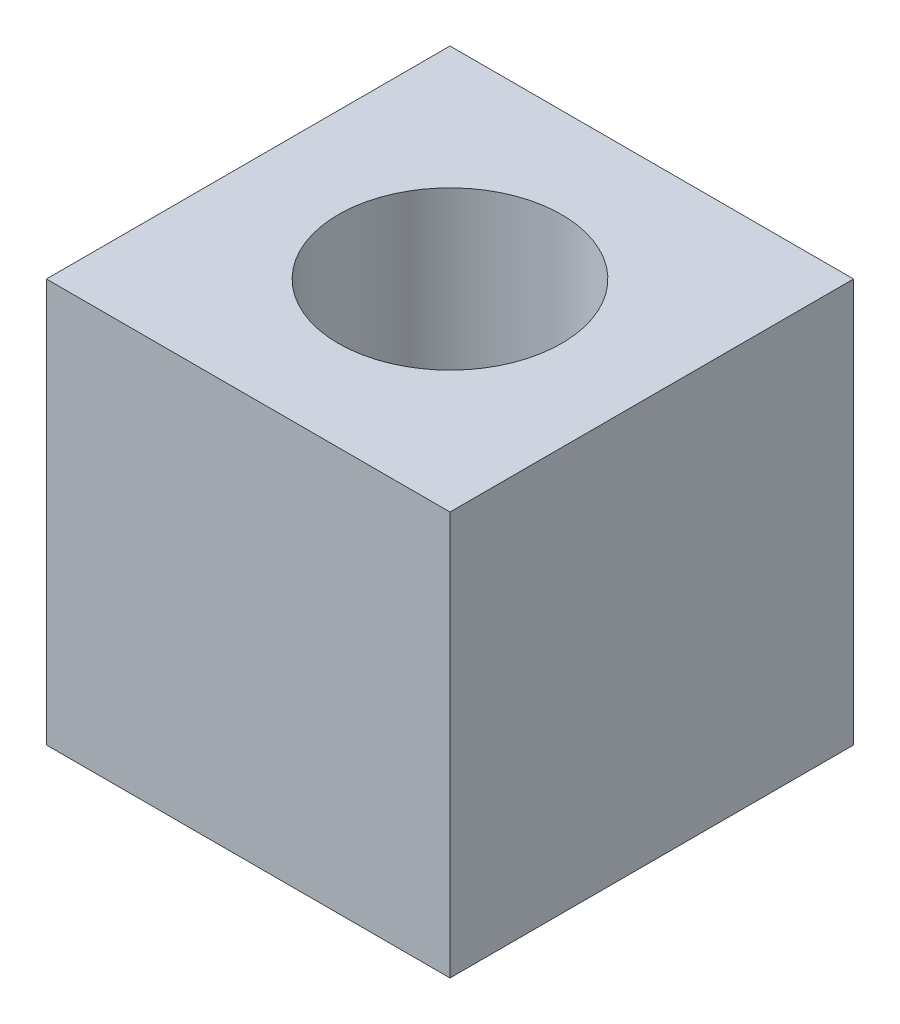
ISO-10303-21;
HEADER;
FILE_DESCRIPTION(('STEP AP214'),'2;1');
FILE_NAME('part.step','',(''),(''),'','','');
FILE_SCHEMA(('AUTOMOTIVE_DESIGN { 1 0 10303 214 1 1 1 1 }'));
ENDSEC;
DATA;
#1=APPLICATION_CONTEXT('core data for automotive mechanical design processes');
#2=APPLICATION_PROTOCOL_DEFINITION('international standard','automotive_design',2000,#1);
#3=PRODUCT_CONTEXT('',#1,'mechanical');
#4=PRODUCT('Part','Part','',(#3));
#5=PRODUCT_RELATED_PRODUCT_CATEGORY('part','',(#4));
#6=PRODUCT_DEFINITION_FORMATION('','',#4);
#7=PRODUCT_DEFINITION_CONTEXT('part definition',#1,'design');
#8=PRODUCT_DEFINITION('design','',#6,#7);
#9=PRODUCT_DEFINITION_SHAPE('','',#8);
#10=(LENGTH_UNIT() NAMED_UNIT(*) SI_UNIT(.MILLI.,.METRE.));
#11=(NAMED_UNIT(*) PLANE_ANGLE_UNIT() SI_UNIT($,.RADIAN.));
#12=(NAMED_UNIT(*) SI_UNIT($,.STERADIAN.) SOLID_ANGLE_UNIT());
#13=UNCERTAINTY_MEASURE_WITH_UNIT(LENGTH_MEASURE(1.E-05),#10,'distance_accuracy_value','');
#14=(GEOMETRIC_REPRESENTATION_CONTEXT(3) GLOBAL_UNCERTAINTY_ASSIGNED_CONTEXT((#13)) GLOBAL_UNIT_ASSIGNED_CONTEXT((#10,
#11,#12)) REPRESENTATION_CONTEXT('',''));
#15=CARTESIAN_POINT('',(0.,0.,0.));
#16=DIRECTION('',(0.,0.,1.));
#17=DIRECTION('',(1.,0.,0.));
#18=AXIS2_PLACEMENT_3D('',#15,#16,#17);
#19=CARTESIAN_POINT('',(0.,15.,0.));
#20=DIRECTION('',(0.,1.,0.));
#21=DIRECTION('',(0.,0.,1.));
#22=AXIS2_PLACEMENT_3D('',#19,#20,#21);
#23=PLANE('',#22);
#24=DIRECTION('',(0.,0.,1.));
#25=VECTOR('',#24,1.);
#26=CARTESIAN_POINT('',(-7.5,15.,-7.5));
#27=LINE('',#26,#25);
#28=CARTESIAN_POINT('',(-7.5,15.,-7.5));
#29=VERTEX_POINT('',#28);
#30=CARTESIAN_POINT('',(-7.5,15.,7.5));
#31=VERTEX_POINT('',#30);
#32=EDGE_CURVE('E91',#29,#31,#27,.T.);
#33=ORIENTED_EDGE('',*,*,#32,.T.);
#34=DIRECTION('',(1.,0.,0.));
#35=VECTOR('',#34,1.);
#36=CARTESIAN_POINT('',(-7.5,15.,7.5));
#37=LINE('',#36,#35);
#38=CARTESIAN_POINT('',(7.5,15.,7.5));
#39=VERTEX_POINT('',#38);
#40=EDGE_CURVE('E86',#31,#39,#37,.T.);
#41=ORIENTED_EDGE('',*,*,#40,.T.);
#42=DIRECTION('',(0.,0.,-1.));
#43=VECTOR('',#42,1.);
#44=CARTESIAN_POINT('',(7.5,15.,-7.5));
#45=LINE('',#44,#43);
#46=CARTESIAN_POINT('',(7.5,15.,-7.5));
#47=VERTEX_POINT('',#46);
#48=EDGE_CURVE('E89',#39,#47,#45,.T.);
#49=ORIENTED_EDGE('',*,*,#48,.T.);
#50=DIRECTION('',(-1.,0.,0.));
#51=VECTOR('',#50,1.);
#52=CARTESIAN_POINT('',(-7.5,15.,-7.5));
#53=LINE('',#52,#51);
#54=EDGE_CURVE('E56',#47,#29,#53,.T.);
#55=ORIENTED_EDGE('',*,*,#54,.T.);
#56=EDGE_LOOP('',(#33,#41,#49,#55));
#57=FACE_BOUND('',#56,.T.);
#58=CARTESIAN_POINT('',(0.,15.,0.));
#59=DIRECTION('',(0.,1.,0.));
#60=DIRECTION('',(0.,0.,1.));
#61=AXIS2_PLACEMENT_3D('',#58,#59,#60);
#62=CIRCLE('',#61,4.15);
#63=CARTESIAN_POINT('',(0.,15.,4.15));
#64=VERTEX_POINT('',#63);
#65=EDGE_CURVE('E107',#64,#64,#62,.T.);
#66=ORIENTED_EDGE('',*,*,#65,.F.);
#67=EDGE_LOOP('',(#66));
#68=FACE_BOUND('',#67,.T.);
#69=ADVANCED_FACE('F33',(#57,#68),#23,.T.);
#70=CARTESIAN_POINT('',(0.,0.,0.));
#71=DIRECTION('',(0.,1.,0.));
#72=DIRECTION('',(0.,0.,1.));
#73=AXIS2_PLACEMENT_3D('',#70,#71,#72);
#74=PLANE('',#73);
#75=DIRECTION('',(0.,0.,1.));
#76=VECTOR('',#75,1.);
#77=CARTESIAN_POINT('',(-7.5,0.,-7.5));
#78=LINE('',#77,#76);
#79=CARTESIAN_POINT('',(-7.5,0.,-7.5));
#80=VERTEX_POINT('',#79);
#81=CARTESIAN_POINT('',(-7.5,0.,7.5));
#82=VERTEX_POINT('',#81);
#83=EDGE_CURVE('E104',#80,#82,#78,.T.);
#84=ORIENTED_EDGE('',*,*,#83,.F.);
#85=DIRECTION('',(-1.,0.,0.));
#86=VECTOR('',#85,1.);
#87=CARTESIAN_POINT('',(-7.5,0.,-7.5));
#88=LINE('',#87,#86);
#89=CARTESIAN_POINT('',(7.5,0.,-7.5));
#90=VERTEX_POINT('',#89);
#91=EDGE_CURVE('E79',#90,#80,#88,.T.);
#92=ORIENTED_EDGE('',*,*,#91,.F.);
#93=DIRECTION('',(0.,0.,-1.));
#94=VECTOR('',#93,1.);
#95=CARTESIAN_POINT('',(7.5,0.,-7.5));
#96=LINE('',#95,#94);
#97=CARTESIAN_POINT('',(7.5,0.,7.5));
#98=VERTEX_POINT('',#97);
#99=EDGE_CURVE('E73',#98,#90,#96,.T.);
#100=ORIENTED_EDGE('',*,*,#99,.F.);
#101=DIRECTION('',(1.,0.,0.));
#102=VECTOR('',#101,1.);
#103=CARTESIAN_POINT('',(-7.5,0.,7.5));
#104=LINE('',#103,#102);
#105=EDGE_CURVE('E95',#82,#98,#104,.T.);
#106=ORIENTED_EDGE('',*,*,#105,.F.);
#107=EDGE_LOOP('',(#84,#92,#100,#106));
#108=FACE_BOUND('',#107,.T.);
#109=CARTESIAN_POINT('',(0.,0.,0.));
#110=DIRECTION('',(0.,1.,0.));
#111=DIRECTION('',(0.,0.,1.));
#112=AXIS2_PLACEMENT_3D('',#109,#110,#111);
#113=CIRCLE('',#112,4.15);
#114=CARTESIAN_POINT('',(0.,0.,4.15));
#115=VERTEX_POINT('',#114);
#116=EDGE_CURVE('E119',#115,#115,#113,.T.);
#117=ORIENTED_EDGE('',*,*,#116,.T.);
#118=EDGE_LOOP('',(#117));
#119=FACE_BOUND('',#118,.T.);
#120=ADVANCED_FACE('F115',(#108,#119),#74,.F.);
#121=CARTESIAN_POINT('',(-7.5,15.,-7.5));
#122=DIRECTION('',(1.,0.,0.));
#123=DIRECTION('',(0.,0.,-1.));
#124=AXIS2_PLACEMENT_3D('',#121,#122,#123);
#125=PLANE('',#124);
#126=ORIENTED_EDGE('',*,*,#83,.T.);
#127=DIRECTION('',(0.,-1.,0.));
#128=VECTOR('',#127,1.);
#129=CARTESIAN_POINT('',(-7.5,15.,7.5));
#130=LINE('',#129,#128);
#131=EDGE_CURVE('E11',#31,#82,#130,.T.);
#132=ORIENTED_EDGE('',*,*,#131,.F.);
#133=ORIENTED_EDGE('',*,*,#32,.F.);
#134=DIRECTION('',(0.,-1.,0.));
#135=VECTOR('',#134,1.);
#136=CARTESIAN_POINT('',(-7.5,15.,-7.5));
#137=LINE('',#136,#135);
#138=EDGE_CURVE('E100',#29,#80,#137,.T.);
#139=ORIENTED_EDGE('',*,*,#138,.T.);
#140=EDGE_LOOP('',(#126,#132,#133,#139));
#141=FACE_BOUND('',#140,.T.);
#142=ADVANCED_FACE('F35',(#141),#125,.F.);
#143=CARTESIAN_POINT('',(-7.5,15.,7.5));
#144=DIRECTION('',(0.,0.,-1.));
#145=DIRECTION('',(-1.,0.,0.));
#146=AXIS2_PLACEMENT_3D('',#143,#144,#145);
#147=PLANE('',#146);
#148=ORIENTED_EDGE('',*,*,#105,.T.);
#149=DIRECTION('',(0.,-1.,0.));
#150=VECTOR('',#149,1.);
#151=CARTESIAN_POINT('',(7.5,15.,7.5));
#152=LINE('',#151,#150);
#153=EDGE_CURVE('E48',#39,#98,#152,.T.);
#154=ORIENTED_EDGE('',*,*,#153,.F.);
#155=ORIENTED_EDGE('',*,*,#40,.F.);
#156=ORIENTED_EDGE('',*,*,#131,.T.);
#157=EDGE_LOOP('',(#148,#154,#155,#156));
#158=FACE_BOUND('',#157,.T.);
#159=ADVANCED_FACE('F94',(#158),#147,.F.);
#160=CARTESIAN_POINT('',(7.5,15.,-7.5));
#161=DIRECTION('',(-1.,0.,0.));
#162=DIRECTION('',(0.,0.,1.));
#163=AXIS2_PLACEMENT_3D('',#160,#161,#162);
#164=PLANE('',#163);
#165=ORIENTED_EDGE('',*,*,#99,.T.);
#166=DIRECTION('',(0.,-1.,0.));
#167=VECTOR('',#166,1.);
#168=CARTESIAN_POINT('',(7.5,15.,-7.5));
#169=LINE('',#168,#167);
#170=EDGE_CURVE('E96',#47,#90,#169,.T.);
#171=ORIENTED_EDGE('',*,*,#170,.F.);
#172=ORIENTED_EDGE('',*,*,#48,.F.);
#173=ORIENTED_EDGE('',*,*,#153,.T.);
#174=EDGE_LOOP('',(#165,#171,#172,#173));
#175=FACE_BOUND('',#174,.T.);
#176=ADVANCED_FACE('F98',(#175),#164,.F.);
#177=CARTESIAN_POINT('',(-7.5,15.,-7.5));
#178=DIRECTION('',(0.,0.,1.));
#179=DIRECTION('',(1.,0.,0.));
#180=AXIS2_PLACEMENT_3D('',#177,#178,#179);
#181=PLANE('',#180);
#182=CARTESIAN_POINT('',(0.,7.5,-7.5));
#183=DIRECTION('',(0.,0.,1.));
#184=DIRECTION('',(1.,0.,0.));
#185=AXIS2_PLACEMENT_3D('',#182,#183,#184);
#186=CIRCLE('',#185,2.15);
#187=CARTESIAN_POINT('',(2.15,7.5,-7.5));
#188=VERTEX_POINT('',#187);
#189=EDGE_CURVE('E124',#188,#188,#186,.T.);
#190=ORIENTED_EDGE('',*,*,#189,.T.);
#191=EDGE_LOOP('',(#190));
#192=FACE_BOUND('',#191,.T.);
#193=ORIENTED_EDGE('',*,*,#91,.T.);
#194=ORIENTED_EDGE('',*,*,#138,.F.);
#195=ORIENTED_EDGE('',*,*,#54,.F.);
#196=ORIENTED_EDGE('',*,*,#170,.T.);
#197=EDGE_LOOP('',(#193,#194,#195,#196));
#198=FACE_BOUND('',#197,.T.);
#199=ADVANCED_FACE('F112',(#192,#198),#181,.F.);
#200=CARTESIAN_POINT('',(0.,15.,0.));
#201=DIRECTION('',(0.,-1.,0.));
#202=DIRECTION('',(0.,0.,-1.));
#203=AXIS2_PLACEMENT_3D('',#200,#201,#202);
#204=CYLINDRICAL_SURFACE('',#203,4.15);
#205=CARTESIAN_POINT('',(0.,9.65,-4.15));
#206=CARTESIAN_POINT('',(-0.112530907992224,9.64999135127052,-4.1499925526258));
#207=CARTESIAN_POINT('',(-0.225186204114529,9.64111268162533,-4.14537416520222));
#208=CARTESIAN_POINT('',(-0.447133208089032,9.60600242714915,-4.12735130994415));
#209=CARTESIAN_POINT('',(-0.556418819168291,9.57974112262095,-4.11393179487539));
#210=CARTESIAN_POINT('',(-0.768087151959658,9.51118592729929,-4.07970501012566));
#211=CARTESIAN_POINT('',(-0.870495440681473,9.46895579035938,-4.05892713855759));
#212=CARTESIAN_POINT('',(-1.06660375762212,9.37000848338247,-4.01186258089857));
#213=CARTESIAN_POINT('',(-1.16030407027543,9.31329178675669,-3.98557607483121));
#214=CARTESIAN_POINT('',(-1.34303449345309,9.18289814362247,-3.92791435960101));
#215=CARTESIAN_POINT('',(-1.43138922001038,9.1083723269184,-3.89632190573566));
#216=CARTESIAN_POINT('',(-1.59497499263734,8.94631582003862,-3.83226914812694));
#217=CARTESIAN_POINT('',(-1.67019524257435,8.85877453995514,-3.79980815550835));
#218=CARTESIAN_POINT('',(-1.81179031058658,8.66429332221192,-3.73450115752597));
#219=CARTESIAN_POINT('',(-1.87687429817327,8.556337927896,-3.7018558901462));
#220=CARTESIAN_POINT('',(-1.98769143155295,8.32916777765895,-3.64355980303117));
#221=CARTESIAN_POINT('',(-2.03343907386397,8.20996153884625,-3.61790374860957));
#222=CARTESIAN_POINT('',(-2.10119233780657,7.97109175115961,-3.57895851073428));
#223=CARTESIAN_POINT('',(-2.12448519065327,7.8519072997938,-3.5650057382779));
#224=CARTESIAN_POINT('',(-2.15057152029877,7.61057535121314,-3.54933822684322));
#225=CARTESIAN_POINT('',(-2.15338811084255,7.48843135113745,-3.54760968912515));
#226=CARTESIAN_POINT('',(-2.13938301977687,7.26185075588393,-3.55606030184828));
#227=CARTESIAN_POINT('',(-2.12508063703453,7.15718684664716,-3.56471222633815));
#228=CARTESIAN_POINT('',(-2.08164098063239,6.95203078132926,-3.59025061449613));
#229=CARTESIAN_POINT('',(-2.05249835699875,6.85154014387159,-3.60714004773056));
#230=CARTESIAN_POINT('',(-1.97971437551039,6.65471735538492,-3.64760052065233));
#231=CARTESIAN_POINT('',(-1.93575503475699,6.55853396135229,-3.67131627067422));
#232=CARTESIAN_POINT('',(-1.83483795108317,6.37443228344441,-3.72277789516));
#233=CARTESIAN_POINT('',(-1.77787437861877,6.28651773136291,-3.75052557502561));
#234=CARTESIAN_POINT('',(-1.64344901750174,6.10872681919509,-3.81152663758024));
#235=CARTESIAN_POINT('',(-1.56424585338419,6.0202421021003,-3.84501252087502));
#236=CARTESIAN_POINT('',(-1.39204771235311,5.85720631951072,-3.91065175541686));
#237=CARTESIAN_POINT('',(-1.29904523966012,5.78266287697057,-3.94280437021143));
#238=CARTESIAN_POINT('',(-1.09565557605311,5.64586026462391,-4.00423511123333));
#239=CARTESIAN_POINT('',(-0.984606392862347,5.58446652478748,-4.03326902515709));
#240=CARTESIAN_POINT('',(-0.75187610358758,5.4817530291786,-4.08304963649111));
#241=CARTESIAN_POINT('',(-0.630204114572689,5.44041625542734,-4.10380335683124));
#242=CARTESIAN_POINT('',(-0.390987014366551,5.38258811469148,-4.13314307684574));
#243=CARTESIAN_POINT('',(-0.273999270775157,5.36425277830933,-4.14262830366925));
#244=CARTESIAN_POINT('',(-0.0382428739149641,5.3470988491074,-4.15149641638465));
#245=CARTESIAN_POINT('',(0.0805248062897991,5.34826995523369,-4.15088463435403));
#246=CARTESIAN_POINT('',(0.305772230388833,5.36910575139316,-4.14012665274711));
#247=CARTESIAN_POINT('',(0.412442104981775,5.38719896592584,-4.13079068890366));
#248=CARTESIAN_POINT('',(0.620994106638108,5.43883294634358,-4.10462123753719));
#249=CARTESIAN_POINT('',(0.722875721166861,5.47237536177742,-4.08778694940617));
#250=CARTESIAN_POINT('',(0.922154694072801,5.55473105122435,-4.04756077996075));
#251=CARTESIAN_POINT('',(1.01935852466269,5.60392972878202,-4.02400514713174));
#252=CARTESIAN_POINT('',(1.20443214101203,5.71575030068322,-3.97254130039726));
#253=CARTESIAN_POINT('',(1.29229808568197,5.77837768713519,-3.94463130691));
#254=CARTESIAN_POINT('',(1.46586041344484,5.92273082803972,-3.88369181960064));
#255=CARTESIAN_POINT('',(1.55039144192469,6.00576225164308,-3.85043142221219));
#256=CARTESIAN_POINT('',(1.70488738076703,6.18476096308129,-3.78456431061426));
#257=CARTESIAN_POINT('',(1.77484037519763,6.28073872839369,-3.75195815069043));
#258=CARTESIAN_POINT('',(1.90210392455899,6.48988295821954,-3.68915046550489));
#259=CARTESIAN_POINT('',(1.95843885714507,6.60372553815903,-3.65920019560415));
#260=CARTESIAN_POINT('',(2.05055706099108,6.84129797947413,-3.60839580585733));
#261=CARTESIAN_POINT('',(2.08636850889412,6.96501401829303,-3.58752922455084));
#262=CARTESIAN_POINT('',(2.13297687239374,7.20596035594102,-3.55999694015437));
#263=CARTESIAN_POINT('',(2.14587468840951,7.3226445724585,-3.5521436567715));
#264=CARTESIAN_POINT('',(2.15243296253004,7.55672640943155,-3.54817685181443));
#265=CARTESIAN_POINT('',(2.1461040609382,7.67412359942918,-3.55205683689887));
#266=CARTESIAN_POINT('',(2.1163861347211,7.8927382919701,-3.56982416339604));
#267=CARTESIAN_POINT('',(2.09493262282053,7.99432419340461,-3.58257415423383));
#268=CARTESIAN_POINT('',(2.03809461964692,8.19230372510057,-3.61520924130007));
#269=CARTESIAN_POINT('',(2.00270533486369,8.28869555576559,-3.63509679243782));
#270=CARTESIAN_POINT('',(1.91640805331373,8.48065363075755,-3.68136126864796));
#271=CARTESIAN_POINT('',(1.8646275386369,8.57574245036516,-3.70808073059347));
#272=CARTESIAN_POINT('',(1.7479308542877,8.75651436915597,-3.7644972622033));
#273=CARTESIAN_POINT('',(1.68300765377521,8.84219239591606,-3.79419592131745));
#274=CARTESIAN_POINT('',(1.53169646049787,9.01365783363523,-3.85797888928815));
#275=CARTESIAN_POINT('',(1.44359865079756,9.09792541265027,-3.8921182225448));
#276=CARTESIAN_POINT('',(1.25371170368901,9.25088286354075,-3.95737328128674));
#277=CARTESIAN_POINT('',(1.15191451550923,9.31956351113359,-3.9884872101579));
#278=CARTESIAN_POINT('',(0.934914204043428,9.44011040915149,-4.04488984484766));
#279=CARTESIAN_POINT('',(0.819525244390333,9.49169489814408,-4.07007912192965));
#280=CARTESIAN_POINT('',(0.640157949370078,9.55346259789828,-4.1007808190511));
#281=CARTESIAN_POINT('',(0.579363490924752,9.57144363437826,-4.1098307274323));
#282=CARTESIAN_POINT('',(0.456122065243397,9.60201652156669,-4.12532377491441));
#283=CARTESIAN_POINT('',(0.393676080673938,9.61461150366852,-4.13176842856256));
#284=CARTESIAN_POINT('',(0.276120711228534,9.63291067127412,-4.14116594682379));
#285=CARTESIAN_POINT('',(0.221146676390503,9.63931100790516,-4.14447045880017));
#286=CARTESIAN_POINT('',(0.110791820690279,9.64785785212775,-4.14888934496449));
#287=CARTESIAN_POINT('',(0.0554109901985362,9.65000425869366,-4.15000366713809));
#288=CARTESIAN_POINT('',(0.,9.65,-4.15));
#289=B_SPLINE_CURVE_WITH_KNOTS('',3,(#205,#206,#207,#208,#209,#210,#211,#212,#213,#214,#215,
#216,#217,#218,#219,#220,#221,#222,#223,#224,#225,#226,#227,#228,#229,#230,#231,#232,#233,#234,
#235,#236,#237,#238,#239,#240,#241,#242,#243,#244,#245,#246,#247,#248,#249,#250,#251,#252,#253,
#254,#255,#256,#257,#258,#259,#260,#261,#262,#263,#264,#265,#266,#267,#268,#269,#270,#271,#272,
#273,#274,#275,#276,#277,#278,#279,#280,#281,#282,#283,#284,#285,#286,#287,#288),.UNSPECIFIED.,
.T.,.F.,(4,2,2,2,2,2,2,2,2,2,2,2,2,2,2,2,2,2,2,2,2,2,2,2,2,2,2,2,2,2,2,2,2,2,2,2,2,2,2,2,2,4),
(0.,0.337377589291966,0.675333499947687,1.01195416436984,1.34856382965752,1.70656857783123,
2.06486622358357,2.45354462437301,2.84193111267844,3.20642913125163,3.5705156379892,
3.88700272685875,4.20360399161085,4.52748536412398,4.85151221244992,5.22008191481736,
5.58885256207787,5.97725878486494,6.36533487307274,6.7197516659897,7.07398130275581,
7.39827084722408,7.72259502490564,8.05561677277409,8.38877498141938,8.75640791282951,
9.12434017499957,9.51373713700953,9.90259820822859,10.2534932058653,10.6041940492505,
10.9166539395722,11.2292214012375,11.5624886369005,11.8959346313339,12.2740047856534,
12.6522981002837,13.0365474930765,13.2284205430473,13.4201818879516,13.5863049795813,
13.752432016384),.UNSPECIFIED.);
#290=CARTESIAN_POINT('',(0.,9.65,-4.15));
#291=VERTEX_POINT('',#290);
#292=EDGE_CURVE('E37',#291,#291,#289,.T.);
#293=ORIENTED_EDGE('',*,*,#292,.F.);
#294=EDGE_LOOP('',(#293));
#295=FACE_BOUND('',#294,.T.);
#296=ORIENTED_EDGE('',*,*,#65,.T.);
#297=EDGE_LOOP('',(#296));
#298=FACE_BOUND('',#297,.T.);
#299=ORIENTED_EDGE('',*,*,#116,.F.);
#300=EDGE_LOOP('',(#299));
#301=FACE_BOUND('',#300,.T.);
#302=ADVANCED_FACE('F134',(#295,#298,#301),#204,.F.);
#303=CARTESIAN_POINT('',(0.,7.5,-7.5));
#304=DIRECTION('',(0.,0.,1.));
#305=DIRECTION('',(1.,0.,0.));
#306=AXIS2_PLACEMENT_3D('',#303,#304,#305);
#307=CYLINDRICAL_SURFACE('',#306,2.15);
#308=ORIENTED_EDGE('',*,*,#292,.T.);
#309=EDGE_LOOP('',(#308));
#310=FACE_BOUND('',#309,.T.);
#311=ORIENTED_EDGE('',*,*,#189,.F.);
#312=EDGE_LOOP('',(#311));
#313=FACE_BOUND('',#312,.T.);
#314=ADVANCED_FACE('F131',(#310,#313),#307,.F.);
#315=CLOSED_SHELL('',(#69,#120,#142,#159,#176,#199,#302,#314));
#316=MANIFOLD_SOLID_BREP('B2',#315);
#317=ADVANCED_BREP_SHAPE_REPRESENTATION('',(#18,#316),#14);
#318=SHAPE_DEFINITION_REPRESENTATION(#9,#317);
ENDSEC;
END-ISO-10303-21;
